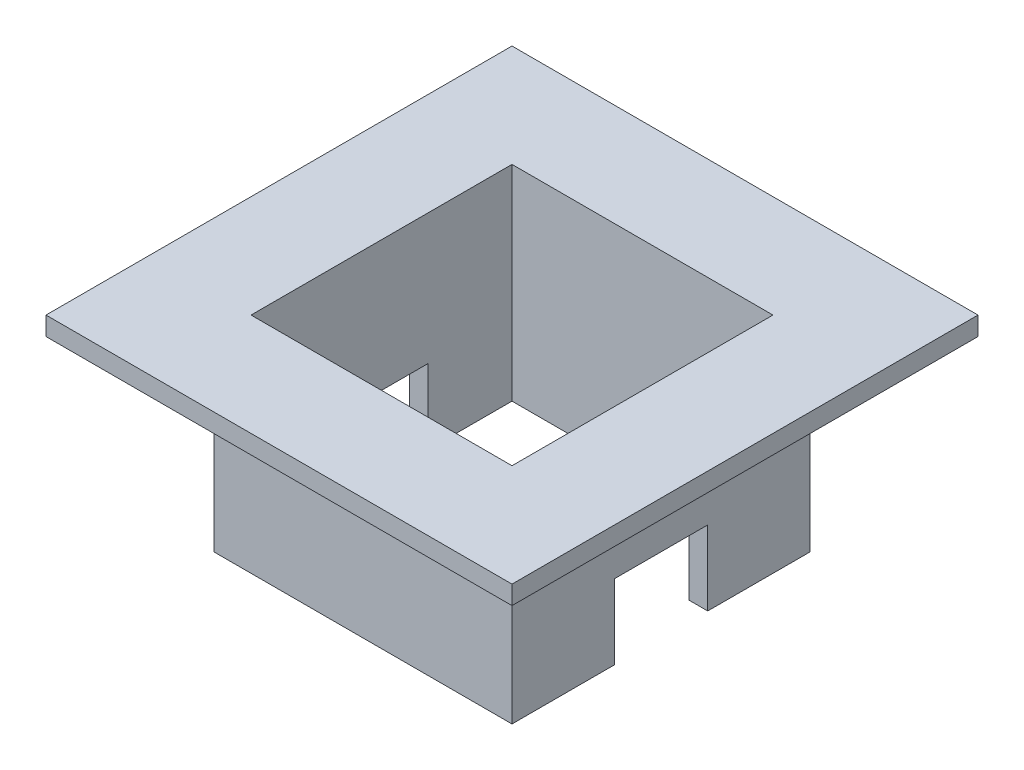
ISO-10303-21;
HEADER;
FILE_DESCRIPTION(('STEP AP214'),'2;1');
FILE_NAME('part.step','',(''),(''),'','','');
FILE_SCHEMA(('AUTOMOTIVE_DESIGN { 1 0 10303 214 1 1 1 1 }'));
ENDSEC;
DATA;
#1=APPLICATION_CONTEXT('core data for automotive mechanical design processes');
#2=APPLICATION_PROTOCOL_DEFINITION('international standard','automotive_design',2000,#1);
#3=PRODUCT_CONTEXT('',#1,'mechanical');
#4=PRODUCT('Part','Part','',(#3));
#5=PRODUCT_RELATED_PRODUCT_CATEGORY('part','',(#4));
#6=PRODUCT_DEFINITION_FORMATION('','',#4);
#7=PRODUCT_DEFINITION_CONTEXT('part definition',#1,'design');
#8=PRODUCT_DEFINITION('design','',#6,#7);
#9=PRODUCT_DEFINITION_SHAPE('','',#8);
#10=(LENGTH_UNIT() NAMED_UNIT(*) SI_UNIT(.MILLI.,.METRE.));
#11=(NAMED_UNIT(*) PLANE_ANGLE_UNIT() SI_UNIT($,.RADIAN.));
#12=(NAMED_UNIT(*) SI_UNIT($,.STERADIAN.) SOLID_ANGLE_UNIT());
#13=UNCERTAINTY_MEASURE_WITH_UNIT(LENGTH_MEASURE(1.E-05),#10,'distance_accuracy_value','');
#14=(GEOMETRIC_REPRESENTATION_CONTEXT(3) GLOBAL_UNCERTAINTY_ASSIGNED_CONTEXT((#13)) GLOBAL_UNIT_ASSIGNED_CONTEXT((#10,
#11,#12)) REPRESENTATION_CONTEXT('',''));
#15=CARTESIAN_POINT('',(0.,0.,0.));
#16=DIRECTION('',(0.,0.,1.));
#17=DIRECTION('',(1.,0.,0.));
#18=AXIS2_PLACEMENT_3D('',#15,#16,#17);
#19=CARTESIAN_POINT('',(0.,0.,0.));
#20=DIRECTION('',(0.,-1.,0.));
#21=DIRECTION('',(0.,0.,-1.));
#22=AXIS2_PLACEMENT_3D('',#19,#20,#21);
#23=PLANE('',#22);
#24=DIRECTION('',(1.,0.,0.));
#25=VECTOR('',#24,1.);
#26=CARTESIAN_POINT('',(-16.,0.,5.));
#27=LINE('',#26,#25);
#28=CARTESIAN_POINT('',(14.,0.,5.));
#29=VERTEX_POINT('',#28);
#30=CARTESIAN_POINT('',(16.,0.,5.));
#31=VERTEX_POINT('',#30);
#32=EDGE_CURVE('E242',#29,#31,#27,.T.);
#33=ORIENTED_EDGE('',*,*,#32,.T.);
#34=DIRECTION('',(0.,0.,-1.));
#35=VECTOR('',#34,1.);
#36=CARTESIAN_POINT('',(16.,0.,16.));
#37=LINE('',#36,#35);
#38=CARTESIAN_POINT('',(16.,0.,16.));
#39=VERTEX_POINT('',#38);
#40=EDGE_CURVE('E301',#39,#31,#37,.T.);
#41=ORIENTED_EDGE('',*,*,#40,.F.);
#42=DIRECTION('',(1.,0.,0.));
#43=VECTOR('',#42,1.);
#44=CARTESIAN_POINT('',(16.,0.,16.));
#45=LINE('',#44,#43);
#46=CARTESIAN_POINT('',(-16.,0.,16.));
#47=VERTEX_POINT('',#46);
#48=EDGE_CURVE('E283',#47,#39,#45,.T.);
#49=ORIENTED_EDGE('',*,*,#48,.F.);
#50=DIRECTION('',(0.,0.,1.));
#51=VECTOR('',#50,1.);
#52=CARTESIAN_POINT('',(-16.,0.,16.));
#53=LINE('',#52,#51);
#54=CARTESIAN_POINT('',(-16.,0.,5.));
#55=VERTEX_POINT('',#54);
#56=EDGE_CURVE('E306',#55,#47,#53,.T.);
#57=ORIENTED_EDGE('',*,*,#56,.F.);
#58=CARTESIAN_POINT('',(-14.,0.,5.));
#59=VERTEX_POINT('',#58);
#60=EDGE_CURVE('E258',#55,#59,#27,.T.);
#61=ORIENTED_EDGE('',*,*,#60,.T.);
#62=DIRECTION('',(0.,0.,1.));
#63=VECTOR('',#62,1.);
#64=CARTESIAN_POINT('',(-14.,0.,14.));
#65=LINE('',#64,#63);
#66=CARTESIAN_POINT('',(-14.,0.,14.));
#67=VERTEX_POINT('',#66);
#68=EDGE_CURVE('E266',#59,#67,#65,.T.);
#69=ORIENTED_EDGE('',*,*,#68,.T.);
#70=DIRECTION('',(1.,0.,0.));
#71=VECTOR('',#70,1.);
#72=CARTESIAN_POINT('',(14.,0.,14.));
#73=LINE('',#72,#71);
#74=CARTESIAN_POINT('',(14.,0.,14.));
#75=VERTEX_POINT('',#74);
#76=EDGE_CURVE('E270',#67,#75,#73,.T.);
#77=ORIENTED_EDGE('',*,*,#76,.T.);
#78=DIRECTION('',(0.,0.,-1.));
#79=VECTOR('',#78,1.);
#80=CARTESIAN_POINT('',(14.,0.,14.));
#81=LINE('',#80,#79);
#82=EDGE_CURVE('E274',#75,#29,#81,.T.);
#83=ORIENTED_EDGE('',*,*,#82,.T.);
#84=EDGE_LOOP('',(#33,#41,#49,#57,#61,#69,#77,#83));
#85=FACE_BOUND('',#84,.T.);
#86=ADVANCED_FACE('F33',(#85),#23,.T.);
#87=DIRECTION('',(1.,0.,0.));
#88=VECTOR('',#87,1.);
#89=CARTESIAN_POINT('',(-16.,0.,-5.00000000000001));
#90=LINE('',#89,#88);
#91=CARTESIAN_POINT('',(-16.,0.,-5.00000000000001));
#92=VERTEX_POINT('',#91);
#93=CARTESIAN_POINT('',(-14.,0.,-5.));
#94=VERTEX_POINT('',#93);
#95=EDGE_CURVE('E48',#92,#94,#90,.T.);
#96=ORIENTED_EDGE('',*,*,#95,.F.);
#97=CARTESIAN_POINT('',(-16.,0.,-16.));
#98=VERTEX_POINT('',#97);
#99=EDGE_CURVE('E288',#98,#92,#53,.T.);
#100=ORIENTED_EDGE('',*,*,#99,.F.);
#101=DIRECTION('',(-1.,0.,0.));
#102=VECTOR('',#101,1.);
#103=CARTESIAN_POINT('',(16.,0.,-16.));
#104=LINE('',#103,#102);
#105=CARTESIAN_POINT('',(16.,0.,-16.));
#106=VERTEX_POINT('',#105);
#107=EDGE_CURVE('E304',#106,#98,#104,.T.);
#108=ORIENTED_EDGE('',*,*,#107,.F.);
#109=CARTESIAN_POINT('',(16.,0.,-5.00000000000001));
#110=VERTEX_POINT('',#109);
#111=EDGE_CURVE('E300',#110,#106,#37,.T.);
#112=ORIENTED_EDGE('',*,*,#111,.F.);
#113=CARTESIAN_POINT('',(14.,0.,-5.00000000000001));
#114=VERTEX_POINT('',#113);
#115=EDGE_CURVE('E257',#114,#110,#90,.T.);
#116=ORIENTED_EDGE('',*,*,#115,.F.);
#117=CARTESIAN_POINT('',(14.,0.,-14.));
#118=VERTEX_POINT('',#117);
#119=EDGE_CURVE('E273',#114,#118,#81,.T.);
#120=ORIENTED_EDGE('',*,*,#119,.T.);
#121=DIRECTION('',(-1.,0.,0.));
#122=VECTOR('',#121,1.);
#123=CARTESIAN_POINT('',(14.,0.,-14.));
#124=LINE('',#123,#122);
#125=CARTESIAN_POINT('',(-14.,0.,-14.));
#126=VERTEX_POINT('',#125);
#127=EDGE_CURVE('E178',#118,#126,#124,.T.);
#128=ORIENTED_EDGE('',*,*,#127,.T.);
#129=EDGE_CURVE('E267',#126,#94,#65,.T.);
#130=ORIENTED_EDGE('',*,*,#129,.T.);
#131=EDGE_LOOP('',(#96,#100,#108,#112,#116,#120,#128,#130));
#132=FACE_BOUND('',#131,.T.);
#133=ADVANCED_FACE('F331',(#132),#23,.T.);
#134=CARTESIAN_POINT('',(16.,20.,16.));
#135=DIRECTION('',(0.,0.,-1.));
#136=DIRECTION('',(-1.,0.,0.));
#137=AXIS2_PLACEMENT_3D('',#134,#135,#136);
#138=PLANE('',#137);
#139=ORIENTED_EDGE('',*,*,#48,.T.);
#140=DIRECTION('',(0.,-1.,0.));
#141=VECTOR('',#140,1.);
#142=CARTESIAN_POINT('',(16.,20.,16.));
#143=LINE('',#142,#141);
#144=CARTESIAN_POINT('',(16.,20.,16.));
#145=VERTEX_POINT('',#144);
#146=EDGE_CURVE('E317',#145,#39,#143,.T.);
#147=ORIENTED_EDGE('',*,*,#146,.F.);
#148=DIRECTION('',(1.,0.,0.));
#149=VECTOR('',#148,1.);
#150=CARTESIAN_POINT('',(16.,20.,16.));
#151=LINE('',#150,#149);
#152=CARTESIAN_POINT('',(-16.,20.,16.));
#153=VERTEX_POINT('',#152);
#154=EDGE_CURVE('E284',#153,#145,#151,.T.);
#155=ORIENTED_EDGE('',*,*,#154,.F.);
#156=DIRECTION('',(0.,-1.,0.));
#157=VECTOR('',#156,1.);
#158=CARTESIAN_POINT('',(-16.,20.,16.));
#159=LINE('',#158,#157);
#160=EDGE_CURVE('E297',#153,#47,#159,.T.);
#161=ORIENTED_EDGE('',*,*,#160,.T.);
#162=EDGE_LOOP('',(#139,#147,#155,#161));
#163=FACE_BOUND('',#162,.T.);
#164=ADVANCED_FACE('F35',(#163),#138,.F.);
#165=CARTESIAN_POINT('',(16.,20.,16.));
#166=DIRECTION('',(-1.,0.,0.));
#167=DIRECTION('',(0.,0.,1.));
#168=AXIS2_PLACEMENT_3D('',#165,#166,#167);
#169=PLANE('',#168);
#170=ORIENTED_EDGE('',*,*,#40,.T.);
#171=DIRECTION('',(0.,-1.,0.));
#172=VECTOR('',#171,1.);
#173=CARTESIAN_POINT('',(16.,8.,5.));
#174=LINE('',#173,#172);
#175=CARTESIAN_POINT('',(16.,8.,5.));
#176=VERTEX_POINT('',#175);
#177=EDGE_CURVE('E231',#176,#31,#174,.T.);
#178=ORIENTED_EDGE('',*,*,#177,.F.);
#179=DIRECTION('',(0.,0.,1.));
#180=VECTOR('',#179,1.);
#181=CARTESIAN_POINT('',(16.,8.,-5.));
#182=LINE('',#181,#180);
#183=CARTESIAN_POINT('',(16.,8.,-5.));
#184=VERTEX_POINT('',#183);
#185=EDGE_CURVE('E236',#184,#176,#182,.T.);
#186=ORIENTED_EDGE('',*,*,#185,.F.);
#187=DIRECTION('',(0.,1.,0.));
#188=VECTOR('',#187,1.);
#189=CARTESIAN_POINT('',(16.,8.,-5.));
#190=LINE('',#189,#188);
#191=EDGE_CURVE('E244',#110,#184,#190,.T.);
#192=ORIENTED_EDGE('',*,*,#191,.F.);
#193=ORIENTED_EDGE('',*,*,#111,.T.);
#194=DIRECTION('',(0.,-1.,0.));
#195=VECTOR('',#194,1.);
#196=CARTESIAN_POINT('',(16.,20.,-16.));
#197=LINE('',#196,#195);
#198=CARTESIAN_POINT('',(16.,20.,-16.));
#199=VERTEX_POINT('',#198);
#200=EDGE_CURVE('E314',#199,#106,#197,.T.);
#201=ORIENTED_EDGE('',*,*,#200,.F.);
#202=DIRECTION('',(0.,0.,-1.));
#203=VECTOR('',#202,1.);
#204=CARTESIAN_POINT('',(16.,20.,16.));
#205=LINE('',#204,#203);
#206=EDGE_CURVE('E287',#145,#199,#205,.T.);
#207=ORIENTED_EDGE('',*,*,#206,.F.);
#208=ORIENTED_EDGE('',*,*,#146,.T.);
#209=EDGE_LOOP('',(#170,#178,#186,#192,#193,#201,#207,#208));
#210=FACE_BOUND('',#209,.T.);
#211=ADVANCED_FACE('F335',(#210),#169,.F.);
#212=CARTESIAN_POINT('',(16.,20.,-16.));
#213=DIRECTION('',(0.,0.,1.));
#214=DIRECTION('',(1.,0.,0.));
#215=AXIS2_PLACEMENT_3D('',#212,#213,#214);
#216=PLANE('',#215);
#217=ORIENTED_EDGE('',*,*,#107,.T.);
#218=DIRECTION('',(0.,-1.,0.));
#219=VECTOR('',#218,1.);
#220=CARTESIAN_POINT('',(-16.,20.,-16.));
#221=LINE('',#220,#219);
#222=CARTESIAN_POINT('',(-16.,20.,-16.));
#223=VERTEX_POINT('',#222);
#224=EDGE_CURVE('E311',#223,#98,#221,.T.);
#225=ORIENTED_EDGE('',*,*,#224,.F.);
#226=DIRECTION('',(-1.,0.,0.));
#227=VECTOR('',#226,1.);
#228=CARTESIAN_POINT('',(16.,20.,-16.));
#229=LINE('',#228,#227);
#230=EDGE_CURVE('E291',#199,#223,#229,.T.);
#231=ORIENTED_EDGE('',*,*,#230,.F.);
#232=ORIENTED_EDGE('',*,*,#200,.T.);
#233=EDGE_LOOP('',(#217,#225,#231,#232));
#234=FACE_BOUND('',#233,.T.);
#235=ADVANCED_FACE('F339',(#234),#216,.F.);
#236=CARTESIAN_POINT('',(-16.,20.,16.));
#237=DIRECTION('',(1.,0.,0.));
#238=DIRECTION('',(0.,0.,-1.));
#239=AXIS2_PLACEMENT_3D('',#236,#237,#238);
#240=PLANE('',#239);
#241=DIRECTION('',(0.,0.,1.));
#242=VECTOR('',#241,1.);
#243=CARTESIAN_POINT('',(-16.,8.,-5.));
#244=LINE('',#243,#242);
#245=CARTESIAN_POINT('',(-16.,8.,-5.));
#246=VERTEX_POINT('',#245);
#247=CARTESIAN_POINT('',(-16.,8.,5.));
#248=VERTEX_POINT('',#247);
#249=EDGE_CURVE('E239',#246,#248,#244,.T.);
#250=ORIENTED_EDGE('',*,*,#249,.T.);
#251=DIRECTION('',(0.,-1.,0.));
#252=VECTOR('',#251,1.);
#253=CARTESIAN_POINT('',(-16.,8.,5.));
#254=LINE('',#253,#252);
#255=EDGE_CURVE('E232',#248,#55,#254,.T.);
#256=ORIENTED_EDGE('',*,*,#255,.T.);
#257=ORIENTED_EDGE('',*,*,#56,.T.);
#258=ORIENTED_EDGE('',*,*,#160,.F.);
#259=DIRECTION('',(0.,0.,1.));
#260=VECTOR('',#259,1.);
#261=CARTESIAN_POINT('',(-16.,20.,16.));
#262=LINE('',#261,#260);
#263=EDGE_CURVE('E294',#223,#153,#262,.T.);
#264=ORIENTED_EDGE('',*,*,#263,.F.);
#265=ORIENTED_EDGE('',*,*,#224,.T.);
#266=ORIENTED_EDGE('',*,*,#99,.T.);
#267=DIRECTION('',(0.,1.,0.));
#268=VECTOR('',#267,1.);
#269=CARTESIAN_POINT('',(-16.,8.,-5.));
#270=LINE('',#269,#268);
#271=EDGE_CURVE('E235',#92,#246,#270,.T.);
#272=ORIENTED_EDGE('',*,*,#271,.T.);
#273=EDGE_LOOP('',(#250,#256,#257,#258,#264,#265,#266,#272));
#274=FACE_BOUND('',#273,.T.);
#275=ADVANCED_FACE('F361',(#274),#240,.F.);
#276=CARTESIAN_POINT('',(-14.,20.,14.));
#277=DIRECTION('',(1.,0.,0.));
#278=DIRECTION('',(0.,0.,-1.));
#279=AXIS2_PLACEMENT_3D('',#276,#277,#278);
#280=PLANE('',#279);
#281=DIRECTION('',(0.,-1.,0.));
#282=VECTOR('',#281,1.);
#283=CARTESIAN_POINT('',(-14.,20.,5.));
#284=LINE('',#283,#282);
#285=CARTESIAN_POINT('',(-14.,8.,5.));
#286=VERTEX_POINT('',#285);
#287=EDGE_CURVE('E264',#286,#59,#284,.T.);
#288=ORIENTED_EDGE('',*,*,#287,.F.);
#289=DIRECTION('',(0.,0.,1.));
#290=VECTOR('',#289,1.);
#291=CARTESIAN_POINT('',(-14.,8.,14.));
#292=LINE('',#291,#290);
#293=CARTESIAN_POINT('',(-14.,8.,-5.));
#294=VERTEX_POINT('',#293);
#295=EDGE_CURVE('E262',#294,#286,#292,.T.);
#296=ORIENTED_EDGE('',*,*,#295,.F.);
#297=DIRECTION('',(0.,1.,0.));
#298=VECTOR('',#297,1.);
#299=CARTESIAN_POINT('',(-14.,20.,-4.99999999999999));
#300=LINE('',#299,#298);
#301=EDGE_CURVE('E251',#94,#294,#300,.T.);
#302=ORIENTED_EDGE('',*,*,#301,.F.);
#303=ORIENTED_EDGE('',*,*,#129,.F.);
#304=DIRECTION('',(0.,-1.,0.));
#305=VECTOR('',#304,1.);
#306=CARTESIAN_POINT('',(-14.,20.,-14.));
#307=LINE('',#306,#305);
#308=CARTESIAN_POINT('',(-14.,22.,-14.));
#309=VERTEX_POINT('',#308);
#310=EDGE_CURVE('E182',#309,#126,#307,.T.);
#311=ORIENTED_EDGE('',*,*,#310,.F.);
#312=DIRECTION('',(0.,0.,1.));
#313=VECTOR('',#312,1.);
#314=CARTESIAN_POINT('',(-14.,22.,14.));
#315=LINE('',#314,#313);
#316=CARTESIAN_POINT('',(-14.,22.,14.));
#317=VERTEX_POINT('',#316);
#318=EDGE_CURVE('E195',#309,#317,#315,.T.);
#319=ORIENTED_EDGE('',*,*,#318,.T.);
#320=DIRECTION('',(0.,-1.,0.));
#321=VECTOR('',#320,1.);
#322=CARTESIAN_POINT('',(-14.,20.,14.));
#323=LINE('',#322,#321);
#324=EDGE_CURVE('E280',#317,#67,#323,.T.);
#325=ORIENTED_EDGE('',*,*,#324,.T.);
#326=ORIENTED_EDGE('',*,*,#68,.F.);
#327=EDGE_LOOP('',(#288,#296,#302,#303,#311,#319,#325,#326));
#328=FACE_BOUND('',#327,.T.);
#329=ADVANCED_FACE('F359',(#328),#280,.T.);
#330=CARTESIAN_POINT('',(14.,20.,14.));
#331=DIRECTION('',(0.,0.,-1.));
#332=DIRECTION('',(-1.,0.,0.));
#333=AXIS2_PLACEMENT_3D('',#330,#331,#332);
#334=PLANE('',#333);
#335=ORIENTED_EDGE('',*,*,#76,.F.);
#336=ORIENTED_EDGE('',*,*,#324,.F.);
#337=DIRECTION('',(1.,0.,0.));
#338=VECTOR('',#337,1.);
#339=CARTESIAN_POINT('',(-14.,22.,14.));
#340=LINE('',#339,#338);
#341=CARTESIAN_POINT('',(14.,22.,14.));
#342=VERTEX_POINT('',#341);
#343=EDGE_CURVE('E197',#317,#342,#340,.T.);
#344=ORIENTED_EDGE('',*,*,#343,.T.);
#345=DIRECTION('',(0.,-1.,0.));
#346=VECTOR('',#345,1.);
#347=CARTESIAN_POINT('',(14.,20.,14.));
#348=LINE('',#347,#346);
#349=EDGE_CURVE('E181',#342,#75,#348,.T.);
#350=ORIENTED_EDGE('',*,*,#349,.T.);
#351=EDGE_LOOP('',(#335,#336,#344,#350));
#352=FACE_BOUND('',#351,.T.);
#353=ADVANCED_FACE('F356',(#352),#334,.T.);
#354=CARTESIAN_POINT('',(14.,20.,14.));
#355=DIRECTION('',(-1.,0.,0.));
#356=DIRECTION('',(0.,0.,1.));
#357=AXIS2_PLACEMENT_3D('',#354,#355,#356);
#358=PLANE('',#357);
#359=DIRECTION('',(0.,1.,0.));
#360=VECTOR('',#359,1.);
#361=CARTESIAN_POINT('',(14.,20.,5.));
#362=LINE('',#361,#360);
#363=CARTESIAN_POINT('',(14.,8.,5.));
#364=VERTEX_POINT('',#363);
#365=EDGE_CURVE('E11',#29,#364,#362,.T.);
#366=ORIENTED_EDGE('',*,*,#365,.F.);
#367=ORIENTED_EDGE('',*,*,#82,.F.);
#368=ORIENTED_EDGE('',*,*,#349,.F.);
#369=DIRECTION('',(0.,0.,-1.));
#370=VECTOR('',#369,1.);
#371=CARTESIAN_POINT('',(14.,22.,14.));
#372=LINE('',#371,#370);
#373=CARTESIAN_POINT('',(14.,22.,-14.));
#374=VERTEX_POINT('',#373);
#375=EDGE_CURVE('E185',#342,#374,#372,.T.);
#376=ORIENTED_EDGE('',*,*,#375,.T.);
#377=DIRECTION('',(0.,-1.,0.));
#378=VECTOR('',#377,1.);
#379=CARTESIAN_POINT('',(14.,20.,-14.));
#380=LINE('',#379,#378);
#381=EDGE_CURVE('E170',#374,#118,#380,.T.);
#382=ORIENTED_EDGE('',*,*,#381,.T.);
#383=ORIENTED_EDGE('',*,*,#119,.F.);
#384=DIRECTION('',(0.,-1.,0.));
#385=VECTOR('',#384,1.);
#386=CARTESIAN_POINT('',(14.,20.,-4.99999999999999));
#387=LINE('',#386,#385);
#388=CARTESIAN_POINT('',(14.,8.,-5.));
#389=VERTEX_POINT('',#388);
#390=EDGE_CURVE('E320',#389,#114,#387,.T.);
#391=ORIENTED_EDGE('',*,*,#390,.F.);
#392=DIRECTION('',(0.,0.,-1.));
#393=VECTOR('',#392,1.);
#394=CARTESIAN_POINT('',(14.,8.,14.));
#395=LINE('',#394,#393);
#396=EDGE_CURVE('E41',#364,#389,#395,.T.);
#397=ORIENTED_EDGE('',*,*,#396,.F.);
#398=EDGE_LOOP('',(#366,#367,#368,#376,#382,#383,#391,#397));
#399=FACE_BOUND('',#398,.T.);
#400=ADVANCED_FACE('F187',(#399),#358,.T.);
#401=CARTESIAN_POINT('',(14.,20.,-14.));
#402=DIRECTION('',(0.,0.,1.));
#403=DIRECTION('',(1.,0.,0.));
#404=AXIS2_PLACEMENT_3D('',#401,#402,#403);
#405=PLANE('',#404);
#406=ORIENTED_EDGE('',*,*,#127,.F.);
#407=ORIENTED_EDGE('',*,*,#381,.F.);
#408=DIRECTION('',(-1.,0.,0.));
#409=VECTOR('',#408,1.);
#410=CARTESIAN_POINT('',(-14.,22.,-14.));
#411=LINE('',#410,#409);
#412=EDGE_CURVE('E175',#374,#309,#411,.T.);
#413=ORIENTED_EDGE('',*,*,#412,.T.);
#414=ORIENTED_EDGE('',*,*,#310,.T.);
#415=EDGE_LOOP('',(#406,#407,#413,#414));
#416=FACE_BOUND('',#415,.T.);
#417=ADVANCED_FACE('F172',(#416),#405,.T.);
#418=CARTESIAN_POINT('',(-16.,8.,-5.));
#419=DIRECTION('',(0.,0.,-1.));
#420=DIRECTION('',(0.,1.,0.));
#421=AXIS2_PLACEMENT_3D('',#418,#419,#420);
#422=PLANE('',#421);
#423=ORIENTED_EDGE('',*,*,#390,.T.);
#424=ORIENTED_EDGE('',*,*,#115,.T.);
#425=ORIENTED_EDGE('',*,*,#191,.T.);
#426=DIRECTION('',(1.,0.,0.));
#427=VECTOR('',#426,1.);
#428=CARTESIAN_POINT('',(-16.,8.,-5.));
#429=LINE('',#428,#427);
#430=EDGE_CURVE('E56',#389,#184,#429,.T.);
#431=ORIENTED_EDGE('',*,*,#430,.F.);
#432=EDGE_LOOP('',(#423,#424,#425,#431));
#433=FACE_BOUND('',#432,.T.);
#434=ADVANCED_FACE('F327',(#433),#422,.F.);
#435=CARTESIAN_POINT('',(-16.,8.,-5.));
#436=DIRECTION('',(0.,1.,0.));
#437=DIRECTION('',(0.,0.,1.));
#438=AXIS2_PLACEMENT_3D('',#435,#436,#437);
#439=PLANE('',#438);
#440=ORIENTED_EDGE('',*,*,#396,.T.);
#441=ORIENTED_EDGE('',*,*,#430,.T.);
#442=ORIENTED_EDGE('',*,*,#185,.T.);
#443=DIRECTION('',(1.,0.,0.));
#444=VECTOR('',#443,1.);
#445=CARTESIAN_POINT('',(-16.,8.,5.));
#446=LINE('',#445,#444);
#447=EDGE_CURVE('E252',#364,#176,#446,.T.);
#448=ORIENTED_EDGE('',*,*,#447,.F.);
#449=EDGE_LOOP('',(#440,#441,#442,#448));
#450=FACE_BOUND('',#449,.T.);
#451=ADVANCED_FACE('F325',(#450),#439,.F.);
#452=CARTESIAN_POINT('',(-16.,8.,5.));
#453=DIRECTION('',(0.,0.,1.));
#454=DIRECTION('',(0.,-1.,0.));
#455=AXIS2_PLACEMENT_3D('',#452,#453,#454);
#456=PLANE('',#455);
#457=ORIENTED_EDGE('',*,*,#365,.T.);
#458=ORIENTED_EDGE('',*,*,#447,.T.);
#459=ORIENTED_EDGE('',*,*,#177,.T.);
#460=ORIENTED_EDGE('',*,*,#32,.F.);
#461=EDGE_LOOP('',(#457,#458,#459,#460));
#462=FACE_BOUND('',#461,.T.);
#463=ADVANCED_FACE('F352',(#462),#456,.F.);
#464=ORIENTED_EDGE('',*,*,#287,.T.);
#465=ORIENTED_EDGE('',*,*,#60,.F.);
#466=ORIENTED_EDGE('',*,*,#255,.F.);
#467=EDGE_CURVE('E248',#248,#286,#446,.T.);
#468=ORIENTED_EDGE('',*,*,#467,.T.);
#469=EDGE_LOOP('',(#464,#465,#466,#468));
#470=FACE_BOUND('',#469,.T.);
#471=ADVANCED_FACE('F365',(#470),#456,.F.);
#472=ORIENTED_EDGE('',*,*,#295,.T.);
#473=ORIENTED_EDGE('',*,*,#467,.F.);
#474=ORIENTED_EDGE('',*,*,#249,.F.);
#475=EDGE_CURVE('E253',#246,#294,#429,.T.);
#476=ORIENTED_EDGE('',*,*,#475,.T.);
#477=EDGE_LOOP('',(#472,#473,#474,#476));
#478=FACE_BOUND('',#477,.T.);
#479=ADVANCED_FACE('F368',(#478),#439,.F.);
#480=ORIENTED_EDGE('',*,*,#301,.T.);
#481=ORIENTED_EDGE('',*,*,#475,.F.);
#482=ORIENTED_EDGE('',*,*,#271,.F.);
#483=ORIENTED_EDGE('',*,*,#95,.T.);
#484=EDGE_LOOP('',(#480,#481,#482,#483));
#485=FACE_BOUND('',#484,.T.);
#486=ADVANCED_FACE('F369',(#485),#422,.F.);
#487=CARTESIAN_POINT('',(0.,20.,0.));
#488=DIRECTION('',(0.,-1.,0.));
#489=DIRECTION('',(0.,0.,-1.));
#490=AXIS2_PLACEMENT_3D('',#487,#488,#489);
#491=PLANE('',#490);
#492=DIRECTION('',(0.,0.,-1.));
#493=VECTOR('',#492,1.);
#494=CARTESIAN_POINT('',(25.,20.,25.));
#495=LINE('',#494,#493);
#496=CARTESIAN_POINT('',(25.,20.,25.));
#497=VERTEX_POINT('',#496);
#498=CARTESIAN_POINT('',(25.,20.,-25.));
#499=VERTEX_POINT('',#498);
#500=EDGE_CURVE('E201',#497,#499,#495,.T.);
#501=ORIENTED_EDGE('',*,*,#500,.F.);
#502=DIRECTION('',(1.,0.,0.));
#503=VECTOR('',#502,1.);
#504=CARTESIAN_POINT('',(-25.,20.,25.));
#505=LINE('',#504,#503);
#506=CARTESIAN_POINT('',(-25.,20.,25.));
#507=VERTEX_POINT('',#506);
#508=EDGE_CURVE('E206',#507,#497,#505,.T.);
#509=ORIENTED_EDGE('',*,*,#508,.F.);
#510=DIRECTION('',(0.,0.,1.));
#511=VECTOR('',#510,1.);
#512=CARTESIAN_POINT('',(-25.,20.,25.));
#513=LINE('',#512,#511);
#514=CARTESIAN_POINT('',(-25.,20.,-25.));
#515=VERTEX_POINT('',#514);
#516=EDGE_CURVE('E217',#515,#507,#513,.T.);
#517=ORIENTED_EDGE('',*,*,#516,.F.);
#518=DIRECTION('',(-1.,0.,0.));
#519=VECTOR('',#518,1.);
#520=CARTESIAN_POINT('',(-25.,20.,-25.));
#521=LINE('',#520,#519);
#522=EDGE_CURVE('E215',#499,#515,#521,.T.);
#523=ORIENTED_EDGE('',*,*,#522,.F.);
#524=EDGE_LOOP('',(#501,#509,#517,#523));
#525=FACE_BOUND('',#524,.T.);
#526=ORIENTED_EDGE('',*,*,#154,.T.);
#527=ORIENTED_EDGE('',*,*,#206,.T.);
#528=ORIENTED_EDGE('',*,*,#230,.T.);
#529=ORIENTED_EDGE('',*,*,#263,.T.);
#530=EDGE_LOOP('',(#526,#527,#528,#529));
#531=FACE_BOUND('',#530,.T.);
#532=ADVANCED_FACE('F342',(#525,#531),#491,.T.);
#533=CARTESIAN_POINT('',(0.,22.,0.));
#534=DIRECTION('',(0.,-1.,0.));
#535=DIRECTION('',(0.,0.,-1.));
#536=AXIS2_PLACEMENT_3D('',#533,#534,#535);
#537=PLANE('',#536);
#538=DIRECTION('',(0.,0.,-1.));
#539=VECTOR('',#538,1.);
#540=CARTESIAN_POINT('',(25.,22.,25.));
#541=LINE('',#540,#539);
#542=CARTESIAN_POINT('',(25.,22.,25.));
#543=VERTEX_POINT('',#542);
#544=CARTESIAN_POINT('',(25.,22.,-25.));
#545=VERTEX_POINT('',#544);
#546=EDGE_CURVE('E202',#543,#545,#541,.T.);
#547=ORIENTED_EDGE('',*,*,#546,.T.);
#548=DIRECTION('',(-1.,0.,0.));
#549=VECTOR('',#548,1.);
#550=CARTESIAN_POINT('',(-25.,22.,-25.));
#551=LINE('',#550,#549);
#552=CARTESIAN_POINT('',(-25.,22.,-25.));
#553=VERTEX_POINT('',#552);
#554=EDGE_CURVE('E205',#545,#553,#551,.T.);
#555=ORIENTED_EDGE('',*,*,#554,.T.);
#556=DIRECTION('',(0.,0.,1.));
#557=VECTOR('',#556,1.);
#558=CARTESIAN_POINT('',(-25.,22.,25.));
#559=LINE('',#558,#557);
#560=CARTESIAN_POINT('',(-25.,22.,25.));
#561=VERTEX_POINT('',#560);
#562=EDGE_CURVE('E208',#553,#561,#559,.T.);
#563=ORIENTED_EDGE('',*,*,#562,.T.);
#564=DIRECTION('',(1.,0.,0.));
#565=VECTOR('',#564,1.);
#566=CARTESIAN_POINT('',(-25.,22.,25.));
#567=LINE('',#566,#565);
#568=EDGE_CURVE('E210',#561,#543,#567,.T.);
#569=ORIENTED_EDGE('',*,*,#568,.T.);
#570=EDGE_LOOP('',(#547,#555,#563,#569));
#571=FACE_BOUND('',#570,.T.);
#572=ORIENTED_EDGE('',*,*,#375,.F.);
#573=ORIENTED_EDGE('',*,*,#343,.F.);
#574=ORIENTED_EDGE('',*,*,#318,.F.);
#575=ORIENTED_EDGE('',*,*,#412,.F.);
#576=EDGE_LOOP('',(#572,#573,#574,#575));
#577=FACE_BOUND('',#576,.T.);
#578=ADVANCED_FACE('F193',(#571,#577),#537,.F.);
#579=CARTESIAN_POINT('',(25.,22.,25.));
#580=DIRECTION('',(-1.,0.,0.));
#581=DIRECTION('',(0.,0.,1.));
#582=AXIS2_PLACEMENT_3D('',#579,#580,#581);
#583=PLANE('',#582);
#584=ORIENTED_EDGE('',*,*,#500,.T.);
#585=DIRECTION('',(0.,-1.,0.));
#586=VECTOR('',#585,1.);
#587=CARTESIAN_POINT('',(25.,22.,-25.));
#588=LINE('',#587,#586);
#589=EDGE_CURVE('E228',#545,#499,#588,.T.);
#590=ORIENTED_EDGE('',*,*,#589,.F.);
#591=ORIENTED_EDGE('',*,*,#546,.F.);
#592=DIRECTION('',(0.,-1.,0.));
#593=VECTOR('',#592,1.);
#594=CARTESIAN_POINT('',(25.,22.,25.));
#595=LINE('',#594,#593);
#596=EDGE_CURVE('E212',#543,#497,#595,.T.);
#597=ORIENTED_EDGE('',*,*,#596,.T.);
#598=EDGE_LOOP('',(#584,#590,#591,#597));
#599=FACE_BOUND('',#598,.T.);
#600=ADVANCED_FACE('F518',(#599),#583,.F.);
#601=CARTESIAN_POINT('',(-25.,22.,-25.));
#602=DIRECTION('',(0.,0.,1.));
#603=DIRECTION('',(1.,0.,0.));
#604=AXIS2_PLACEMENT_3D('',#601,#602,#603);
#605=PLANE('',#604);
#606=ORIENTED_EDGE('',*,*,#522,.T.);
#607=DIRECTION('',(0.,-1.,0.));
#608=VECTOR('',#607,1.);
#609=CARTESIAN_POINT('',(-25.,22.,-25.));
#610=LINE('',#609,#608);
#611=EDGE_CURVE('E225',#553,#515,#610,.T.);
#612=ORIENTED_EDGE('',*,*,#611,.F.);
#613=ORIENTED_EDGE('',*,*,#554,.F.);
#614=ORIENTED_EDGE('',*,*,#589,.T.);
#615=EDGE_LOOP('',(#606,#612,#613,#614));
#616=FACE_BOUND('',#615,.T.);
#617=ADVANCED_FACE('F528',(#616),#605,.F.);
#618=CARTESIAN_POINT('',(-25.,22.,25.));
#619=DIRECTION('',(1.,0.,0.));
#620=DIRECTION('',(0.,0.,-1.));
#621=AXIS2_PLACEMENT_3D('',#618,#619,#620);
#622=PLANE('',#621);
#623=ORIENTED_EDGE('',*,*,#516,.T.);
#624=DIRECTION('',(0.,-1.,0.));
#625=VECTOR('',#624,1.);
#626=CARTESIAN_POINT('',(-25.,22.,25.));
#627=LINE('',#626,#625);
#628=EDGE_CURVE('E222',#561,#507,#627,.T.);
#629=ORIENTED_EDGE('',*,*,#628,.F.);
#630=ORIENTED_EDGE('',*,*,#562,.F.);
#631=ORIENTED_EDGE('',*,*,#611,.T.);
#632=EDGE_LOOP('',(#623,#629,#630,#631));
#633=FACE_BOUND('',#632,.T.);
#634=ADVANCED_FACE('F538',(#633),#622,.F.);
#635=CARTESIAN_POINT('',(-25.,22.,25.));
#636=DIRECTION('',(0.,0.,-1.));
#637=DIRECTION('',(-1.,0.,0.));
#638=AXIS2_PLACEMENT_3D('',#635,#636,#637);
#639=PLANE('',#638);
#640=ORIENTED_EDGE('',*,*,#508,.T.);
#641=ORIENTED_EDGE('',*,*,#596,.F.);
#642=ORIENTED_EDGE('',*,*,#568,.F.);
#643=ORIENTED_EDGE('',*,*,#628,.T.);
#644=EDGE_LOOP('',(#640,#641,#642,#643));
#645=FACE_BOUND('',#644,.T.);
#646=ADVANCED_FACE('F548',(#645),#639,.F.);
#647=CLOSED_SHELL('',(#86,#133,#164,#211,#235,#275,#329,#353,#400,#417,#434,#451,#463,#471,#479,
#486,#532,#578,#600,#617,#634,#646));
#648=MANIFOLD_SOLID_BREP('B2',#647);
#649=ADVANCED_BREP_SHAPE_REPRESENTATION('',(#18,#648),#14);
#650=SHAPE_DEFINITION_REPRESENTATION(#9,#649);
ENDSEC;
END-ISO-10303-21;
